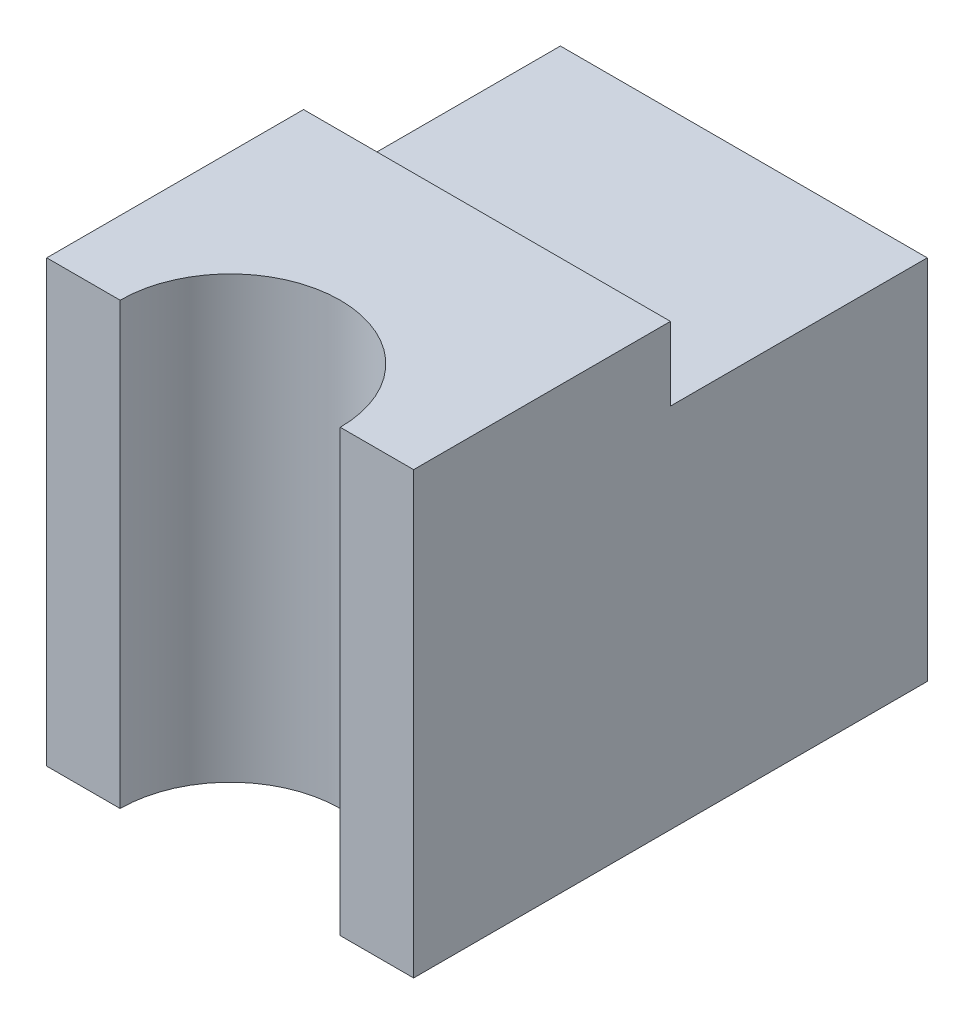
ISO-10303-21;
HEADER;
FILE_DESCRIPTION(('STEP AP214'),'2;1');
FILE_NAME('part.step','',(''),(''),'','','');
FILE_SCHEMA(('AUTOMOTIVE_DESIGN { 1 0 10303 214 1 1 1 1 }'));
ENDSEC;
DATA;
#1=APPLICATION_CONTEXT('core data for automotive mechanical design processes');
#2=APPLICATION_PROTOCOL_DEFINITION('international standard','automotive_design',2000,#1);
#3=PRODUCT_CONTEXT('',#1,'mechanical');
#4=PRODUCT('Part','Part','',(#3));
#5=PRODUCT_RELATED_PRODUCT_CATEGORY('part','',(#4));
#6=PRODUCT_DEFINITION_FORMATION('','',#4);
#7=PRODUCT_DEFINITION_CONTEXT('part definition',#1,'design');
#8=PRODUCT_DEFINITION('design','',#6,#7);
#9=PRODUCT_DEFINITION_SHAPE('','',#8);
#10=(LENGTH_UNIT() NAMED_UNIT(*) SI_UNIT(.MILLI.,.METRE.));
#11=(NAMED_UNIT(*) PLANE_ANGLE_UNIT() SI_UNIT($,.RADIAN.));
#12=(NAMED_UNIT(*) SI_UNIT($,.STERADIAN.) SOLID_ANGLE_UNIT());
#13=UNCERTAINTY_MEASURE_WITH_UNIT(LENGTH_MEASURE(1.E-05),#10,'distance_accuracy_value','');
#14=(GEOMETRIC_REPRESENTATION_CONTEXT(3) GLOBAL_UNCERTAINTY_ASSIGNED_CONTEXT((#13)) GLOBAL_UNIT_ASSIGNED_CONTEXT((#10,
#11,#12)) REPRESENTATION_CONTEXT('',''));
#15=CARTESIAN_POINT('',(0.,0.,0.));
#16=DIRECTION('',(0.,0.,1.));
#17=DIRECTION('',(1.,0.,0.));
#18=AXIS2_PLACEMENT_3D('',#15,#16,#17);
#19=CARTESIAN_POINT('',(0.,0.6,0.));
#20=DIRECTION('',(0.,0.,-1.));
#21=DIRECTION('',(-1.,0.,0.));
#22=AXIS2_PLACEMENT_3D('',#19,#20,#21);
#23=PLANE('',#22);
#24=DIRECTION('',(1.,0.,0.));
#25=VECTOR('',#24,1.);
#26=CARTESIAN_POINT('',(0.,0.,0.));
#27=LINE('',#26,#25);
#28=CARTESIAN_POINT('',(0.,0.,0.));
#29=VERTEX_POINT('',#28);
#30=CARTESIAN_POINT('',(0.1,0.,0.));
#31=VERTEX_POINT('',#30);
#32=EDGE_CURVE('E131',#29,#31,#27,.T.);
#33=ORIENTED_EDGE('',*,*,#32,.T.);
#34=DIRECTION('',(0.,1.,0.));
#35=VECTOR('',#34,1.);
#36=CARTESIAN_POINT('',(0.1,-0.00100000000000002,0.));
#37=LINE('',#36,#35);
#38=CARTESIAN_POINT('',(0.1,0.6,0.));
#39=VERTEX_POINT('',#38);
#40=EDGE_CURVE('E55',#39,#31,#37,.F.);
#41=ORIENTED_EDGE('',*,*,#40,.F.);
#42=DIRECTION('',(1.,0.,0.));
#43=VECTOR('',#42,1.);
#44=CARTESIAN_POINT('',(0.,0.6,0.));
#45=LINE('',#44,#43);
#46=CARTESIAN_POINT('',(0.,0.6,0.));
#47=VERTEX_POINT('',#46);
#48=EDGE_CURVE('E141',#47,#39,#45,.T.);
#49=ORIENTED_EDGE('',*,*,#48,.F.);
#50=DIRECTION('',(0.,-1.,0.));
#51=VECTOR('',#50,1.);
#52=CARTESIAN_POINT('',(0.,0.6,0.));
#53=LINE('',#52,#51);
#54=EDGE_CURVE('E11',#47,#29,#53,.T.);
#55=ORIENTED_EDGE('',*,*,#54,.T.);
#56=EDGE_LOOP('',(#33,#41,#49,#55));
#57=FACE_BOUND('',#56,.T.);
#58=ADVANCED_FACE('F32',(#57),#23,.F.);
#59=CARTESIAN_POINT('',(0.,0.6,0.));
#60=DIRECTION('',(1.,0.,0.));
#61=DIRECTION('',(0.,0.,-1.));
#62=AXIS2_PLACEMENT_3D('',#59,#60,#61);
#63=PLANE('',#62);
#64=DIRECTION('',(0.,0.,1.));
#65=VECTOR('',#64,1.);
#66=CARTESIAN_POINT('',(0.,0.6,0.));
#67=LINE('',#66,#65);
#68=CARTESIAN_POINT('',(0.,0.6,-0.35));
#69=VERTEX_POINT('',#68);
#70=EDGE_CURVE('E129',#69,#47,#67,.T.);
#71=ORIENTED_EDGE('',*,*,#70,.F.);
#72=DIRECTION('',(0.,1.,0.));
#73=VECTOR('',#72,1.);
#74=CARTESIAN_POINT('',(0.,0.5,-0.35));
#75=LINE('',#74,#73);
#76=CARTESIAN_POINT('',(0.,0.5,-0.35));
#77=VERTEX_POINT('',#76);
#78=EDGE_CURVE('E47',#77,#69,#75,.T.);
#79=ORIENTED_EDGE('',*,*,#78,.F.);
#80=DIRECTION('',(0.,0.,1.));
#81=VECTOR('',#80,1.);
#82=CARTESIAN_POINT('',(0.,0.5,-0.699999999999999));
#83=LINE('',#82,#81);
#84=CARTESIAN_POINT('',(0.,0.5,-0.699999999999999));
#85=VERTEX_POINT('',#84);
#86=EDGE_CURVE('E116',#85,#77,#83,.T.);
#87=ORIENTED_EDGE('',*,*,#86,.F.);
#88=DIRECTION('',(0.,-1.,0.));
#89=VECTOR('',#88,1.);
#90=CARTESIAN_POINT('',(0.,0.6,-0.699999999999999));
#91=LINE('',#90,#89);
#92=CARTESIAN_POINT('',(0.,0.,-0.699999999999999));
#93=VERTEX_POINT('',#92);
#94=EDGE_CURVE('E115',#85,#93,#91,.T.);
#95=ORIENTED_EDGE('',*,*,#94,.T.);
#96=DIRECTION('',(0.,0.,1.));
#97=VECTOR('',#96,1.);
#98=CARTESIAN_POINT('',(0.,0.,0.));
#99=LINE('',#98,#97);
#100=EDGE_CURVE('E135',#93,#29,#99,.T.);
#101=ORIENTED_EDGE('',*,*,#100,.T.);
#102=ORIENTED_EDGE('',*,*,#54,.F.);
#103=EDGE_LOOP('',(#71,#79,#87,#95,#101,#102));
#104=FACE_BOUND('',#103,.T.);
#105=ADVANCED_FACE('F34',(#104),#63,.F.);
#106=CARTESIAN_POINT('',(0.4,0.6,0.));
#107=VERTEX_POINT('',#106);
#108=CARTESIAN_POINT('',(0.5,0.6,0.));
#109=VERTEX_POINT('',#108);
#110=EDGE_CURVE('E144',#107,#109,#45,.T.);
#111=ORIENTED_EDGE('',*,*,#110,.F.);
#112=DIRECTION('',(0.,1.,0.));
#113=VECTOR('',#112,1.);
#114=CARTESIAN_POINT('',(0.4,-0.00100000000000002,0.));
#115=LINE('',#114,#113);
#116=CARTESIAN_POINT('',(0.4,0.,0.));
#117=VERTEX_POINT('',#116);
#118=EDGE_CURVE('E150',#117,#107,#115,.T.);
#119=ORIENTED_EDGE('',*,*,#118,.F.);
#120=CARTESIAN_POINT('',(0.5,0.,0.));
#121=VERTEX_POINT('',#120);
#122=EDGE_CURVE('E134',#117,#121,#27,.T.);
#123=ORIENTED_EDGE('',*,*,#122,.T.);
#124=DIRECTION('',(0.,-1.,0.));
#125=VECTOR('',#124,1.);
#126=CARTESIAN_POINT('',(0.5,0.6,0.));
#127=LINE('',#126,#125);
#128=EDGE_CURVE('E40',#109,#121,#127,.T.);
#129=ORIENTED_EDGE('',*,*,#128,.F.);
#130=EDGE_LOOP('',(#111,#119,#123,#129));
#131=FACE_BOUND('',#130,.T.);
#132=ADVANCED_FACE('F174',(#131),#23,.F.);
#133=CARTESIAN_POINT('',(0.5,0.6,0.));
#134=DIRECTION('',(-1.,0.,0.));
#135=DIRECTION('',(0.,0.,1.));
#136=AXIS2_PLACEMENT_3D('',#133,#134,#135);
#137=PLANE('',#136);
#138=DIRECTION('',(0.,0.,-1.));
#139=VECTOR('',#138,1.);
#140=CARTESIAN_POINT('',(0.5,0.5,-0.699999999999999));
#141=LINE('',#140,#139);
#142=CARTESIAN_POINT('',(0.5,0.5,-0.35));
#143=VERTEX_POINT('',#142);
#144=CARTESIAN_POINT('',(0.5,0.5,-0.699999999999999));
#145=VERTEX_POINT('',#144);
#146=EDGE_CURVE('E98',#143,#145,#141,.T.);
#147=ORIENTED_EDGE('',*,*,#146,.F.);
#148=DIRECTION('',(0.,1.,0.));
#149=VECTOR('',#148,1.);
#150=CARTESIAN_POINT('',(0.5,0.5,-0.35));
#151=LINE('',#150,#149);
#152=CARTESIAN_POINT('',(0.5,0.6,-0.35));
#153=VERTEX_POINT('',#152);
#154=EDGE_CURVE('E152',#143,#153,#151,.T.);
#155=ORIENTED_EDGE('',*,*,#154,.T.);
#156=DIRECTION('',(0.,0.,-1.));
#157=VECTOR('',#156,1.);
#158=CARTESIAN_POINT('',(0.5,0.6,0.));
#159=LINE('',#158,#157);
#160=EDGE_CURVE('E124',#109,#153,#159,.T.);
#161=ORIENTED_EDGE('',*,*,#160,.F.);
#162=ORIENTED_EDGE('',*,*,#128,.T.);
#163=DIRECTION('',(0.,0.,-1.));
#164=VECTOR('',#163,1.);
#165=CARTESIAN_POINT('',(0.5,0.,0.));
#166=LINE('',#165,#164);
#167=CARTESIAN_POINT('',(0.5,0.,-0.699999999999999));
#168=VERTEX_POINT('',#167);
#169=EDGE_CURVE('E121',#121,#168,#166,.T.);
#170=ORIENTED_EDGE('',*,*,#169,.T.);
#171=DIRECTION('',(0.,-1.,0.));
#172=VECTOR('',#171,1.);
#173=CARTESIAN_POINT('',(0.5,0.6,-0.699999999999999));
#174=LINE('',#173,#172);
#175=EDGE_CURVE('E113',#145,#168,#174,.T.);
#176=ORIENTED_EDGE('',*,*,#175,.F.);
#177=EDGE_LOOP('',(#147,#155,#161,#162,#170,#176));
#178=FACE_BOUND('',#177,.T.);
#179=ADVANCED_FACE('F118',(#178),#137,.F.);
#180=CARTESIAN_POINT('',(0.,0.6,-0.699999999999999));
#181=DIRECTION('',(0.,0.,1.));
#182=DIRECTION('',(1.,0.,0.));
#183=AXIS2_PLACEMENT_3D('',#180,#181,#182);
#184=PLANE('',#183);
#185=ORIENTED_EDGE('',*,*,#94,.F.);
#186=DIRECTION('',(-1.,0.,0.));
#187=VECTOR('',#186,1.);
#188=CARTESIAN_POINT('',(0.5,0.5,-0.699999999999999));
#189=LINE('',#188,#187);
#190=EDGE_CURVE('E101',#145,#85,#189,.T.);
#191=ORIENTED_EDGE('',*,*,#190,.F.);
#192=ORIENTED_EDGE('',*,*,#175,.T.);
#193=DIRECTION('',(-1.,0.,0.));
#194=VECTOR('',#193,1.);
#195=CARTESIAN_POINT('',(0.,0.,-0.699999999999999));
#196=LINE('',#195,#194);
#197=EDGE_CURVE('E127',#168,#93,#196,.T.);
#198=ORIENTED_EDGE('',*,*,#197,.T.);
#199=EDGE_LOOP('',(#185,#191,#192,#198));
#200=FACE_BOUND('',#199,.T.);
#201=ADVANCED_FACE('F111',(#200),#184,.F.);
#202=CARTESIAN_POINT('',(0.,0.6,0.));
#203=DIRECTION('',(0.,-1.,0.));
#204=DIRECTION('',(0.,0.,-1.));
#205=AXIS2_PLACEMENT_3D('',#202,#203,#204);
#206=PLANE('',#205);
#207=ORIENTED_EDGE('',*,*,#160,.T.);
#208=DIRECTION('',(1.,0.,0.));
#209=VECTOR('',#208,1.);
#210=CARTESIAN_POINT('',(0.5,0.6,-0.35));
#211=LINE('',#210,#209);
#212=EDGE_CURVE('E107',#69,#153,#211,.T.);
#213=ORIENTED_EDGE('',*,*,#212,.F.);
#214=ORIENTED_EDGE('',*,*,#70,.T.);
#215=ORIENTED_EDGE('',*,*,#48,.T.);
#216=CARTESIAN_POINT('',(0.25,0.6,0.));
#217=DIRECTION('',(0.,1.,0.));
#218=DIRECTION('',(0.,0.,1.));
#219=AXIS2_PLACEMENT_3D('',#216,#217,#218);
#220=CIRCLE('',#219,0.15);
#221=EDGE_CURVE('E147',#107,#39,#220,.T.);
#222=ORIENTED_EDGE('',*,*,#221,.F.);
#223=ORIENTED_EDGE('',*,*,#110,.T.);
#224=EDGE_LOOP('',(#207,#213,#214,#215,#222,#223));
#225=FACE_BOUND('',#224,.T.);
#226=ADVANCED_FACE('F163',(#225),#206,.F.);
#227=CARTESIAN_POINT('',(0.,0.,0.));
#228=DIRECTION('',(0.,-1.,0.));
#229=DIRECTION('',(0.,0.,-1.));
#230=AXIS2_PLACEMENT_3D('',#227,#228,#229);
#231=PLANE('',#230);
#232=CARTESIAN_POINT('',(0.25,0.,0.));
#233=DIRECTION('',(0.,-1.,0.));
#234=DIRECTION('',(0.,0.,-1.));
#235=AXIS2_PLACEMENT_3D('',#232,#233,#234);
#236=CIRCLE('',#235,0.15);
#237=EDGE_CURVE('E138',#117,#31,#236,.F.);
#238=ORIENTED_EDGE('',*,*,#237,.T.);
#239=ORIENTED_EDGE('',*,*,#32,.F.);
#240=ORIENTED_EDGE('',*,*,#100,.F.);
#241=ORIENTED_EDGE('',*,*,#197,.F.);
#242=ORIENTED_EDGE('',*,*,#169,.F.);
#243=ORIENTED_EDGE('',*,*,#122,.F.);
#244=EDGE_LOOP('',(#238,#239,#240,#241,#242,#243));
#245=FACE_BOUND('',#244,.T.);
#246=ADVANCED_FACE('F168',(#245),#231,.T.);
#247=CARTESIAN_POINT('',(0.25,-0.00100000000000002,0.));
#248=DIRECTION('',(0.,1.,0.));
#249=DIRECTION('',(0.,0.,1.));
#250=AXIS2_PLACEMENT_3D('',#247,#248,#249);
#251=CYLINDRICAL_SURFACE('',#250,0.15);
#252=ORIENTED_EDGE('',*,*,#40,.T.);
#253=ORIENTED_EDGE('',*,*,#237,.F.);
#254=ORIENTED_EDGE('',*,*,#118,.T.);
#255=ORIENTED_EDGE('',*,*,#221,.T.);
#256=EDGE_LOOP('',(#252,#253,#254,#255));
#257=FACE_BOUND('',#256,.T.);
#258=ADVANCED_FACE('F171',(#257),#251,.F.);
#259=CARTESIAN_POINT('',(0.5,0.5,-0.35));
#260=DIRECTION('',(0.,0.,1.));
#261=DIRECTION('',(1.,0.,0.));
#262=AXIS2_PLACEMENT_3D('',#259,#260,#261);
#263=PLANE('',#262);
#264=ORIENTED_EDGE('',*,*,#212,.T.);
#265=ORIENTED_EDGE('',*,*,#154,.F.);
#266=DIRECTION('',(1.,0.,0.));
#267=VECTOR('',#266,1.);
#268=CARTESIAN_POINT('',(0.5,0.5,-0.35));
#269=LINE('',#268,#267);
#270=EDGE_CURVE('E103',#77,#143,#269,.T.);
#271=ORIENTED_EDGE('',*,*,#270,.F.);
#272=ORIENTED_EDGE('',*,*,#78,.T.);
#273=EDGE_LOOP('',(#264,#265,#271,#272));
#274=FACE_BOUND('',#273,.T.);
#275=ADVANCED_FACE('F158',(#274),#263,.F.);
#276=CARTESIAN_POINT('',(0.,0.5,0.));
#277=DIRECTION('',(0.,-1.,0.));
#278=DIRECTION('',(0.,0.,-1.));
#279=AXIS2_PLACEMENT_3D('',#276,#277,#278);
#280=PLANE('',#279);
#281=ORIENTED_EDGE('',*,*,#146,.T.);
#282=ORIENTED_EDGE('',*,*,#190,.T.);
#283=ORIENTED_EDGE('',*,*,#86,.T.);
#284=ORIENTED_EDGE('',*,*,#270,.T.);
#285=EDGE_LOOP('',(#281,#282,#283,#284));
#286=FACE_BOUND('',#285,.T.);
#287=ADVANCED_FACE('F100',(#286),#280,.F.);
#288=CLOSED_SHELL('',(#58,#105,#132,#179,#201,#226,#246,#258,#275,#287));
#289=MANIFOLD_SOLID_BREP('B2',#288);
#290=ADVANCED_BREP_SHAPE_REPRESENTATION('',(#18,#289),#14);
#291=SHAPE_DEFINITION_REPRESENTATION(#9,#290);
ENDSEC;
END-ISO-10303-21;
